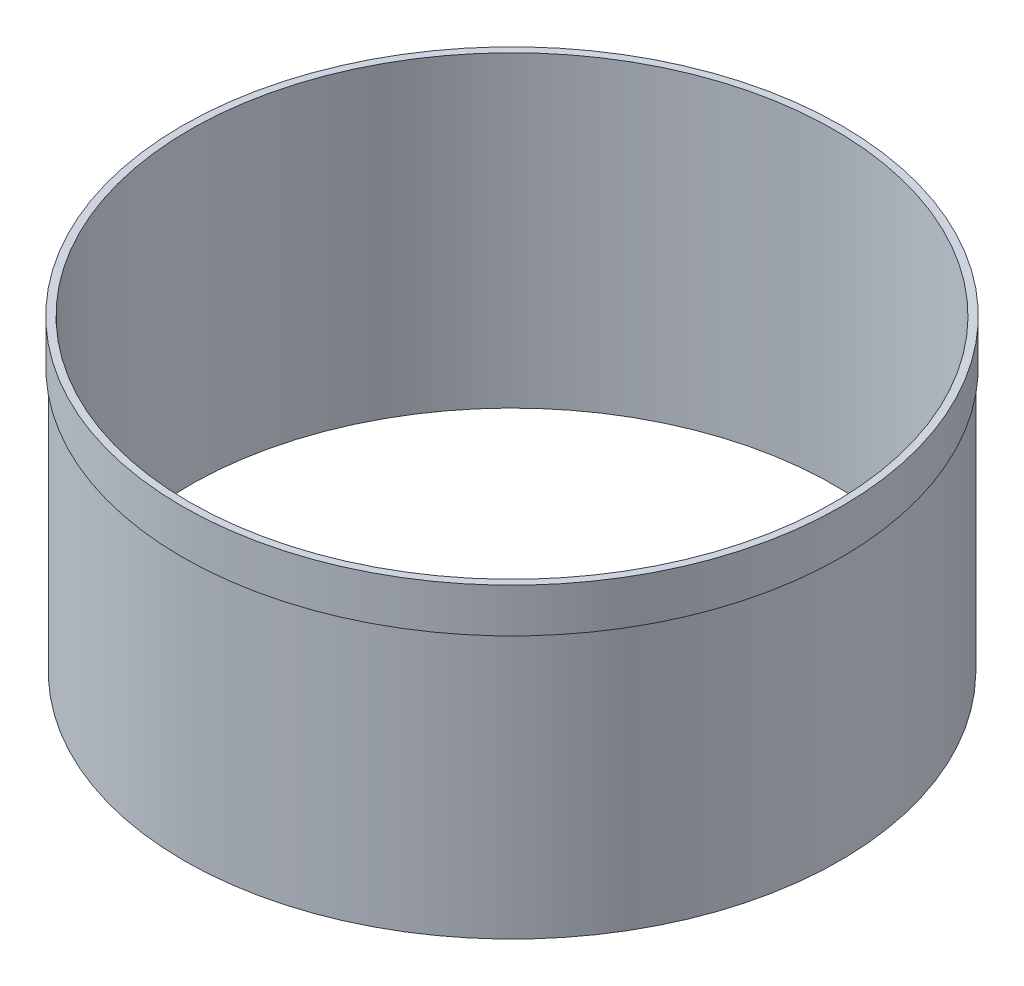
ISO-10303-21;
HEADER;
FILE_DESCRIPTION(('STEP AP214'),'2;1');
FILE_NAME('part.step','',(''),(''),'','','');
FILE_SCHEMA(('AUTOMOTIVE_DESIGN { 1 0 10303 214 1 1 1 1 }'));
ENDSEC;
DATA;
#1=APPLICATION_CONTEXT('core data for automotive mechanical design processes');
#2=APPLICATION_PROTOCOL_DEFINITION('international standard','automotive_design',2000,#1);
#3=PRODUCT_CONTEXT('',#1,'mechanical');
#4=PRODUCT('Part','Part','',(#3));
#5=PRODUCT_RELATED_PRODUCT_CATEGORY('part','',(#4));
#6=PRODUCT_DEFINITION_FORMATION('','',#4);
#7=PRODUCT_DEFINITION_CONTEXT('part definition',#1,'design');
#8=PRODUCT_DEFINITION('design','',#6,#7);
#9=PRODUCT_DEFINITION_SHAPE('','',#8);
#10=(LENGTH_UNIT() NAMED_UNIT(*) SI_UNIT(.MILLI.,.METRE.));
#11=(NAMED_UNIT(*) PLANE_ANGLE_UNIT() SI_UNIT($,.RADIAN.));
#12=(NAMED_UNIT(*) SI_UNIT($,.STERADIAN.) SOLID_ANGLE_UNIT());
#13=UNCERTAINTY_MEASURE_WITH_UNIT(LENGTH_MEASURE(1.E-05),#10,'distance_accuracy_value','');
#14=(GEOMETRIC_REPRESENTATION_CONTEXT(3) GLOBAL_UNCERTAINTY_ASSIGNED_CONTEXT((#13)) GLOBAL_UNIT_ASSIGNED_CONTEXT((#10,
#11,#12)) REPRESENTATION_CONTEXT('',''));
#15=CARTESIAN_POINT('',(0.,0.,0.));
#16=DIRECTION('',(0.,0.,1.));
#17=DIRECTION('',(1.,0.,0.));
#18=AXIS2_PLACEMENT_3D('',#15,#16,#17);
#19=CARTESIAN_POINT('',(0.,88.9,0.));
#20=DIRECTION('',(0.,-1.,0.));
#21=DIRECTION('',(0.,0.,-1.));
#22=AXIS2_PLACEMENT_3D('',#19,#20,#21);
#23=CYLINDRICAL_SURFACE('',#22,94.742);
#24=CARTESIAN_POINT('',(0.,0.,0.));
#25=DIRECTION('',(0.,1.,0.));
#26=DIRECTION('',(0.,0.,1.));
#27=AXIS2_PLACEMENT_3D('',#24,#25,#26);
#28=CIRCLE('',#27,94.742);
#29=CARTESIAN_POINT('',(0.,0.,94.742));
#30=VERTEX_POINT('',#29);
#31=EDGE_CURVE('E39',#30,#30,#28,.T.);
#32=ORIENTED_EDGE('',*,*,#31,.T.);
#33=EDGE_LOOP('',(#32));
#34=FACE_BOUND('',#33,.T.);
#35=CARTESIAN_POINT('',(0.,76.2,0.));
#36=DIRECTION('',(0.,1.,0.));
#37=DIRECTION('',(0.,0.,1.));
#38=AXIS2_PLACEMENT_3D('',#35,#36,#37);
#39=CIRCLE('',#38,94.742);
#40=CARTESIAN_POINT('',(0.,76.2,94.742));
#41=VERTEX_POINT('',#40);
#42=EDGE_CURVE('E10',#41,#41,#39,.T.);
#43=ORIENTED_EDGE('',*,*,#42,.F.);
#44=EDGE_LOOP('',(#43));
#45=FACE_BOUND('',#44,.T.);
#46=ADVANCED_FACE('F33',(#34,#45),#23,.T.);
#47=CARTESIAN_POINT('',(0.,88.9,0.));
#48=DIRECTION('',(0.,1.,0.));
#49=DIRECTION('',(0.,0.,1.));
#50=AXIS2_PLACEMENT_3D('',#47,#48,#49);
#51=PLANE('',#50);
#52=CARTESIAN_POINT('',(0.,88.9,0.));
#53=DIRECTION('',(0.,1.,0.));
#54=DIRECTION('',(0.,0.,1.));
#55=AXIS2_PLACEMENT_3D('',#52,#53,#54);
#56=CIRCLE('',#55,93.1545);
#57=CARTESIAN_POINT('',(0.,88.9,93.1545));
#58=VERTEX_POINT('',#57);
#59=EDGE_CURVE('E43',#58,#58,#56,.T.);
#60=ORIENTED_EDGE('',*,*,#59,.F.);
#61=EDGE_LOOP('',(#60));
#62=FACE_BOUND('',#61,.T.);
#63=CARTESIAN_POINT('',(0.,88.9,0.));
#64=DIRECTION('',(0.,1.,0.));
#65=DIRECTION('',(0.,0.,1.));
#66=AXIS2_PLACEMENT_3D('',#63,#64,#65);
#67=CIRCLE('',#66,95.25);
#68=CARTESIAN_POINT('',(0.,88.9,95.25));
#69=VERTEX_POINT('',#68);
#70=EDGE_CURVE('E53',#69,#69,#67,.T.);
#71=ORIENTED_EDGE('',*,*,#70,.T.);
#72=EDGE_LOOP('',(#71));
#73=FACE_BOUND('',#72,.T.);
#74=ADVANCED_FACE('F71',(#62,#73),#51,.T.);
#75=CARTESIAN_POINT('',(0.,0.,0.));
#76=DIRECTION('',(0.,1.,0.));
#77=DIRECTION('',(0.,0.,1.));
#78=AXIS2_PLACEMENT_3D('',#75,#76,#77);
#79=PLANE('',#78);
#80=ORIENTED_EDGE('',*,*,#31,.F.);
#81=EDGE_LOOP('',(#80));
#82=FACE_BOUND('',#81,.T.);
#83=CARTESIAN_POINT('',(0.,0.,0.));
#84=DIRECTION('',(0.,1.,0.));
#85=DIRECTION('',(0.,0.,1.));
#86=AXIS2_PLACEMENT_3D('',#83,#84,#85);
#87=CIRCLE('',#86,93.1545);
#88=CARTESIAN_POINT('',(0.,0.,93.1545));
#89=VERTEX_POINT('',#88);
#90=EDGE_CURVE('E47',#89,#89,#87,.T.);
#91=ORIENTED_EDGE('',*,*,#90,.T.);
#92=EDGE_LOOP('',(#91));
#93=FACE_BOUND('',#92,.T.);
#94=ADVANCED_FACE('F75',(#82,#93),#79,.F.);
#95=CARTESIAN_POINT('',(0.,88.9,0.));
#96=DIRECTION('',(0.,-1.,0.));
#97=DIRECTION('',(0.,0.,-1.));
#98=AXIS2_PLACEMENT_3D('',#95,#96,#97);
#99=CYLINDRICAL_SURFACE('',#98,93.1545);
#100=ORIENTED_EDGE('',*,*,#59,.T.);
#101=EDGE_LOOP('',(#100));
#102=FACE_BOUND('',#101,.T.);
#103=ORIENTED_EDGE('',*,*,#90,.F.);
#104=EDGE_LOOP('',(#103));
#105=FACE_BOUND('',#104,.T.);
#106=ADVANCED_FACE('F68',(#102,#105),#99,.F.);
#107=CARTESIAN_POINT('',(0.,76.2,0.));
#108=DIRECTION('',(0.,1.,0.));
#109=DIRECTION('',(0.,0.,1.));
#110=AXIS2_PLACEMENT_3D('',#107,#108,#109);
#111=CYLINDRICAL_SURFACE('',#110,95.25);
#112=CARTESIAN_POINT('',(0.,76.2,0.));
#113=DIRECTION('',(0.,1.,0.));
#114=DIRECTION('',(0.,0.,1.));
#115=AXIS2_PLACEMENT_3D('',#112,#113,#114);
#116=CIRCLE('',#115,95.25);
#117=CARTESIAN_POINT('',(0.,76.2,95.25));
#118=VERTEX_POINT('',#117);
#119=EDGE_CURVE('E51',#118,#118,#116,.T.);
#120=ORIENTED_EDGE('',*,*,#119,.T.);
#121=EDGE_LOOP('',(#120));
#122=FACE_BOUND('',#121,.T.);
#123=ORIENTED_EDGE('',*,*,#70,.F.);
#124=EDGE_LOOP('',(#123));
#125=FACE_BOUND('',#124,.T.);
#126=ADVANCED_FACE('F59',(#122,#125),#111,.T.);
#127=CARTESIAN_POINT('',(0.,76.2,0.));
#128=DIRECTION('',(0.,1.,0.));
#129=DIRECTION('',(0.,0.,1.));
#130=AXIS2_PLACEMENT_3D('',#127,#128,#129);
#131=PLANE('',#130);
#132=ORIENTED_EDGE('',*,*,#42,.T.);
#133=EDGE_LOOP('',(#132));
#134=FACE_BOUND('',#133,.T.);
#135=ORIENTED_EDGE('',*,*,#119,.F.);
#136=EDGE_LOOP('',(#135));
#137=FACE_BOUND('',#136,.T.);
#138=ADVANCED_FACE('F62',(#134,#137),#131,.F.);
#139=CLOSED_SHELL('',(#46,#74,#94,#106,#126,#138));
#140=MANIFOLD_SOLID_BREP('B2',#139);
#141=ADVANCED_BREP_SHAPE_REPRESENTATION('',(#18,#140),#14);
#142=SHAPE_DEFINITION_REPRESENTATION(#9,#141);
ENDSEC;
END-ISO-10303-21;
